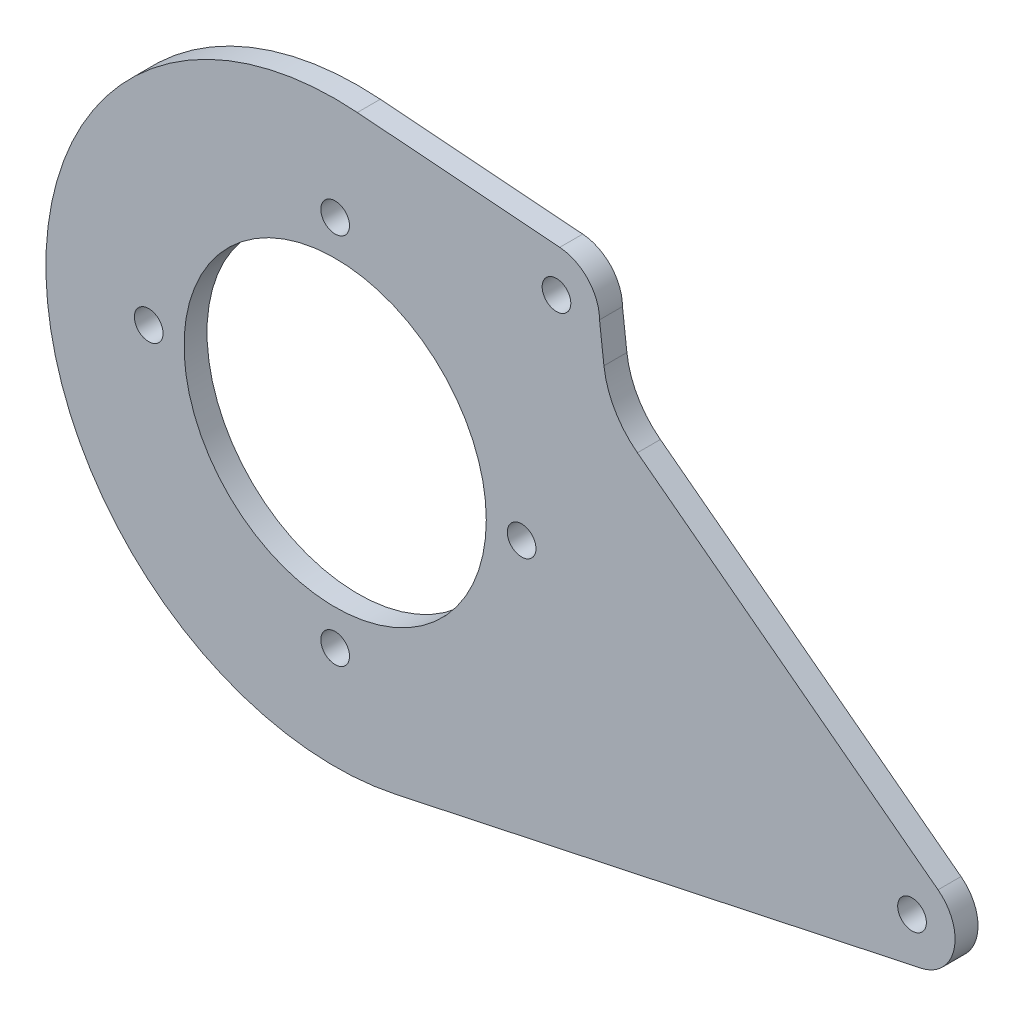
ISO-10303-21;
HEADER;
FILE_DESCRIPTION(('STEP AP214'),'2;1');
FILE_NAME('part.step','',(''),(''),'','','');
FILE_SCHEMA(('AUTOMOTIVE_DESIGN { 1 0 10303 214 1 1 1 1 }'));
ENDSEC;
DATA;
#1=APPLICATION_CONTEXT('core data for automotive mechanical design processes');
#2=APPLICATION_PROTOCOL_DEFINITION('international standard','automotive_design',2000,#1);
#3=PRODUCT_CONTEXT('',#1,'mechanical');
#4=PRODUCT('Part','Part','',(#3));
#5=PRODUCT_RELATED_PRODUCT_CATEGORY('part','',(#4));
#6=PRODUCT_DEFINITION_FORMATION('','',#4);
#7=PRODUCT_DEFINITION_CONTEXT('part definition',#1,'design');
#8=PRODUCT_DEFINITION('design','',#6,#7);
#9=PRODUCT_DEFINITION_SHAPE('','',#8);
#10=(LENGTH_UNIT() NAMED_UNIT(*) SI_UNIT(.MILLI.,.METRE.));
#11=(NAMED_UNIT(*) PLANE_ANGLE_UNIT() SI_UNIT($,.RADIAN.));
#12=(NAMED_UNIT(*) SI_UNIT($,.STERADIAN.) SOLID_ANGLE_UNIT());
#13=UNCERTAINTY_MEASURE_WITH_UNIT(LENGTH_MEASURE(1.E-05),#10,'distance_accuracy_value','');
#14=(GEOMETRIC_REPRESENTATION_CONTEXT(3) GLOBAL_UNCERTAINTY_ASSIGNED_CONTEXT((#13)) GLOBAL_UNIT_ASSIGNED_CONTEXT((#10,
#11,#12)) REPRESENTATION_CONTEXT('',''));
#15=CARTESIAN_POINT('',(0.,0.,0.));
#16=DIRECTION('',(0.,0.,1.));
#17=DIRECTION('',(1.,0.,0.));
#18=AXIS2_PLACEMENT_3D('',#15,#16,#17);
#19=CARTESIAN_POINT('',(0.,0.,10.16));
#20=DIRECTION('',(0.,0.,1.));
#21=DIRECTION('',(1.,0.,0.));
#22=AXIS2_PLACEMENT_3D('',#19,#20,#21);
#23=PLANE('',#22);
#24=CARTESIAN_POINT('',(82.5,0.,10.16));
#25=DIRECTION('',(0.,0.,1.));
#26=DIRECTION('',(1.,0.,0.));
#27=AXIS2_PLACEMENT_3D('',#24,#25,#26);
#28=CIRCLE('',#27,6.35);
#29=CARTESIAN_POINT('',(88.85,0.,10.16));
#30=VERTEX_POINT('',#29);
#31=EDGE_CURVE('E212',#30,#30,#28,.T.);
#32=ORIENTED_EDGE('',*,*,#31,.F.);
#33=EDGE_LOOP('',(#32));
#34=FACE_BOUND('',#33,.T.);
#35=CARTESIAN_POINT('',(-82.5,0.,10.16));
#36=DIRECTION('',(0.,0.,1.));
#37=DIRECTION('',(1.,0.,0.));
#38=AXIS2_PLACEMENT_3D('',#35,#36,#37);
#39=CIRCLE('',#38,6.35);
#40=CARTESIAN_POINT('',(-76.15,0.,10.16));
#41=VERTEX_POINT('',#40);
#42=EDGE_CURVE('E200',#41,#41,#39,.T.);
#43=ORIENTED_EDGE('',*,*,#42,.F.);
#44=EDGE_LOOP('',(#43));
#45=FACE_BOUND('',#44,.T.);
#46=CARTESIAN_POINT('',(0.,0.,10.16));
#47=DIRECTION('',(0.,0.,1.));
#48=DIRECTION('',(1.,0.,0.));
#49=AXIS2_PLACEMENT_3D('',#46,#47,#48);
#50=CIRCLE('',#49,66.87);
#51=CARTESIAN_POINT('',(66.87,0.,10.16));
#52=VERTEX_POINT('',#51);
#53=EDGE_CURVE('E188',#52,#52,#50,.T.);
#54=ORIENTED_EDGE('',*,*,#53,.F.);
#55=EDGE_LOOP('',(#54));
#56=FACE_BOUND('',#55,.T.);
#57=CARTESIAN_POINT('',(0.,0.,10.16));
#58=DIRECTION('',(0.,0.,1.));
#59=DIRECTION('',(1.,0.,0.));
#60=AXIS2_PLACEMENT_3D('',#57,#58,#59);
#61=CIRCLE('',#60,128.);
#62=CARTESIAN_POINT('',(9.80508100267259,127.62390209726,10.16));
#63=VERTEX_POINT('',#62);
#64=CARTESIAN_POINT('',(26.7127683770055,-125.181580137161,10.16));
#65=VERTEX_POINT('',#64);
#66=EDGE_CURVE('E151',#63,#65,#61,.T.);
#67=ORIENTED_EDGE('',*,*,#66,.T.);
#68=DIRECTION('',(0.977981094821572,0.208693502945346,0.));
#69=VECTOR('',#68,1.);
#70=CARTESIAN_POINT('',(26.7127683770055,-125.181580137161,10.16));
#71=LINE('',#70,#69);
#72=CARTESIAN_POINT('',(259.206689864171,-75.5691989310529,10.16));
#73=VERTEX_POINT('',#72);
#74=EDGE_CURVE('E99',#65,#73,#71,.T.);
#75=ORIENTED_EDGE('',*,*,#74,.T.);
#76=CARTESIAN_POINT('',(255.236487197195,-56.9375057502599,10.16));
#77=DIRECTION('',(0.,0.,1.));
#78=DIRECTION('',(1.,0.,0.));
#79=AXIS2_PLACEMENT_3D('',#76,#77,#78);
#80=CIRCLE('',#79,19.0500000000018);
#81=CARTESIAN_POINT('',(266.753249652273,-41.7629651458977,10.16));
#82=VERTEX_POINT('',#81);
#83=EDGE_CURVE('E166',#73,#82,#80,.T.);
#84=ORIENTED_EDGE('',*,*,#83,.T.);
#85=DIRECTION('',(-0.796563811252454,0.604554459584051,0.));
#86=VECTOR('',#85,1.);
#87=CARTESIAN_POINT('',(133.724592453404,59.1995275332562,10.16));
#88=LINE('',#87,#86);
#89=CARTESIAN_POINT('',(133.724592453404,59.1995275332562,10.16));
#90=VERTEX_POINT('',#89);
#91=EDGE_CURVE('E179',#82,#90,#88,.T.);
#92=ORIENTED_EDGE('',*,*,#91,.T.);
#93=CARTESIAN_POINT('',(156.758117363557,89.5486087419742,10.16));
#94=DIRECTION('',(0.,0.,-1.));
#95=DIRECTION('',(-1.,0.,0.));
#96=AXIS2_PLACEMENT_3D('',#93,#94,#95);
#97=CIRCLE('',#96,38.1);
#98=CARTESIAN_POINT('',(118.916102857405,85.1223306083476,10.16));
#99=VERTEX_POINT('',#98);
#100=EDGE_CURVE('E118',#90,#99,#97,.T.);
#101=ORIENTED_EDGE('',*,*,#100,.T.);
#102=DIRECTION('',(-0.116175279097817,0.993228727195576,0.));
#103=VECTOR('',#102,1.);
#104=CARTESIAN_POINT('',(118.916102857405,85.1223306083476,10.16));
#105=LINE('',#104,#103);
#106=CARTESIAN_POINT('',(116.9714473922,101.747964629106,10.16));
#107=VERTEX_POINT('',#106);
#108=EDGE_CURVE('E112',#99,#107,#105,.T.);
#109=ORIENTED_EDGE('',*,*,#108,.T.);
#110=CARTESIAN_POINT('',(97.9214473921997,101.747964629106,10.16));
#111=DIRECTION('',(0.,0.,1.));
#112=DIRECTION('',(1.,0.,0.));
#113=AXIS2_PLACEMENT_3D('',#110,#111,#112);
#114=CIRCLE('',#113,19.05);
#115=CARTESIAN_POINT('',(99.3807192133006,120.741990683425,10.16));
#116=VERTEX_POINT('',#115);
#117=EDGE_CURVE('E116',#107,#116,#114,.T.);
#118=ORIENTED_EDGE('',*,*,#117,.T.);
#119=DIRECTION('',(-0.997061735134844,0.0766021953333798,0.));
#120=VECTOR('',#119,1.);
#121=CARTESIAN_POINT('',(9.80508100267259,127.62390209726,10.16));
#122=LINE('',#121,#120);
#123=EDGE_CURVE('E56',#116,#63,#122,.T.);
#124=ORIENTED_EDGE('',*,*,#123,.T.);
#125=EDGE_LOOP('',(#67,#75,#84,#92,#101,#109,#118,#124));
#126=FACE_BOUND('',#125,.T.);
#127=CARTESIAN_POINT('',(255.236487197195,-56.9375057502599,10.16));
#128=DIRECTION('',(0.,0.,1.));
#129=DIRECTION('',(1.,0.,0.));
#130=AXIS2_PLACEMENT_3D('',#127,#128,#129);
#131=CIRCLE('',#130,6.34999999999994);
#132=CARTESIAN_POINT('',(261.586487197195,-56.9375057502599,10.16));
#133=VERTEX_POINT('',#132);
#134=EDGE_CURVE('E140',#133,#133,#131,.T.);
#135=ORIENTED_EDGE('',*,*,#134,.F.);
#136=EDGE_LOOP('',(#135));
#137=FACE_BOUND('',#136,.T.);
#138=CARTESIAN_POINT('',(0.,82.5,10.16));
#139=DIRECTION('',(0.,0.,1.));
#140=DIRECTION('',(1.,0.,0.));
#141=AXIS2_PLACEMENT_3D('',#138,#139,#140);
#142=CIRCLE('',#141,6.35);
#143=CARTESIAN_POINT('',(6.35,82.5,10.16));
#144=VERTEX_POINT('',#143);
#145=EDGE_CURVE('E194',#144,#144,#142,.T.);
#146=ORIENTED_EDGE('',*,*,#145,.F.);
#147=EDGE_LOOP('',(#146));
#148=FACE_BOUND('',#147,.T.);
#149=CARTESIAN_POINT('',(1.00110585106407E-12,-82.5,10.16));
#150=DIRECTION('',(0.,0.,1.));
#151=DIRECTION('',(1.,0.,0.));
#152=AXIS2_PLACEMENT_3D('',#149,#150,#151);
#153=CIRCLE('',#152,6.35);
#154=CARTESIAN_POINT('',(6.350000000001,-82.5,10.16));
#155=VERTEX_POINT('',#154);
#156=EDGE_CURVE('E206',#155,#155,#153,.T.);
#157=ORIENTED_EDGE('',*,*,#156,.F.);
#158=EDGE_LOOP('',(#157));
#159=FACE_BOUND('',#158,.T.);
#160=CARTESIAN_POINT('',(97.9214473921997,101.747964629106,10.16));
#161=DIRECTION('',(0.,0.,1.));
#162=DIRECTION('',(1.,0.,0.));
#163=AXIS2_PLACEMENT_3D('',#160,#161,#162);
#164=CIRCLE('',#163,6.34999999999999);
#165=CARTESIAN_POINT('',(104.2714473922,101.747964629106,10.16));
#166=VERTEX_POINT('',#165);
#167=EDGE_CURVE('E218',#166,#166,#164,.T.);
#168=ORIENTED_EDGE('',*,*,#167,.F.);
#169=EDGE_LOOP('',(#168));
#170=FACE_BOUND('',#169,.T.);
#171=ADVANCED_FACE('F39',(#34,#45,#56,#126,#137,#148,#159,#170),#23,.T.);
#172=CARTESIAN_POINT('',(0.,0.,0.));
#173=DIRECTION('',(0.,0.,1.));
#174=DIRECTION('',(1.,0.,0.));
#175=AXIS2_PLACEMENT_3D('',#172,#173,#174);
#176=PLANE('',#175);
#177=CARTESIAN_POINT('',(0.,0.,0.));
#178=DIRECTION('',(0.,0.,1.));
#179=DIRECTION('',(1.,0.,0.));
#180=AXIS2_PLACEMENT_3D('',#177,#178,#179);
#181=CIRCLE('',#180,128.);
#182=CARTESIAN_POINT('',(9.80508100267259,127.62390209726,0.));
#183=VERTEX_POINT('',#182);
#184=CARTESIAN_POINT('',(26.7127683770055,-125.181580137161,0.));
#185=VERTEX_POINT('',#184);
#186=EDGE_CURVE('E136',#183,#185,#181,.T.);
#187=ORIENTED_EDGE('',*,*,#186,.F.);
#188=DIRECTION('',(-0.997061735134844,0.0766021953333798,0.));
#189=VECTOR('',#188,1.);
#190=CARTESIAN_POINT('',(9.80508100267259,127.62390209726,0.));
#191=LINE('',#190,#189);
#192=CARTESIAN_POINT('',(99.3807192133006,120.741990683425,0.));
#193=VERTEX_POINT('',#192);
#194=EDGE_CURVE('E91',#193,#183,#191,.T.);
#195=ORIENTED_EDGE('',*,*,#194,.F.);
#196=CARTESIAN_POINT('',(97.9214473921997,101.747964629106,0.));
#197=DIRECTION('',(0.,0.,1.));
#198=DIRECTION('',(1.,0.,0.));
#199=AXIS2_PLACEMENT_3D('',#196,#197,#198);
#200=CIRCLE('',#199,19.05);
#201=CARTESIAN_POINT('',(116.9714473922,101.747964629106,0.));
#202=VERTEX_POINT('',#201);
#203=EDGE_CURVE('E85',#202,#193,#200,.T.);
#204=ORIENTED_EDGE('',*,*,#203,.F.);
#205=DIRECTION('',(-0.116175279097817,0.993228727195576,0.));
#206=VECTOR('',#205,1.);
#207=CARTESIAN_POINT('',(118.916102857405,85.1223306083476,0.));
#208=LINE('',#207,#206);
#209=CARTESIAN_POINT('',(118.916102857405,85.1223306083476,0.));
#210=VERTEX_POINT('',#209);
#211=EDGE_CURVE('E126',#210,#202,#208,.T.);
#212=ORIENTED_EDGE('',*,*,#211,.F.);
#213=CARTESIAN_POINT('',(156.758117363557,89.5486087419742,0.));
#214=DIRECTION('',(0.,0.,-1.));
#215=DIRECTION('',(-1.,0.,0.));
#216=AXIS2_PLACEMENT_3D('',#213,#214,#215);
#217=CIRCLE('',#216,38.1);
#218=CARTESIAN_POINT('',(133.724592453404,59.1995275332562,0.));
#219=VERTEX_POINT('',#218);
#220=EDGE_CURVE('E146',#219,#210,#217,.T.);
#221=ORIENTED_EDGE('',*,*,#220,.F.);
#222=DIRECTION('',(-0.796563811252454,0.604554459584051,0.));
#223=VECTOR('',#222,1.);
#224=CARTESIAN_POINT('',(133.724592453404,59.1995275332562,0.));
#225=LINE('',#224,#223);
#226=CARTESIAN_POINT('',(266.753249652273,-41.7629651458977,0.));
#227=VERTEX_POINT('',#226);
#228=EDGE_CURVE('E144',#227,#219,#225,.T.);
#229=ORIENTED_EDGE('',*,*,#228,.F.);
#230=CARTESIAN_POINT('',(255.236487197195,-56.9375057502599,0.));
#231=DIRECTION('',(0.,0.,1.));
#232=DIRECTION('',(1.,0.,0.));
#233=AXIS2_PLACEMENT_3D('',#230,#231,#232);
#234=CIRCLE('',#233,19.0500000000018);
#235=CARTESIAN_POINT('',(259.206689864171,-75.5691989310529,0.));
#236=VERTEX_POINT('',#235);
#237=EDGE_CURVE('E142',#236,#227,#234,.T.);
#238=ORIENTED_EDGE('',*,*,#237,.F.);
#239=DIRECTION('',(0.977981094821572,0.208693502945346,0.));
#240=VECTOR('',#239,1.);
#241=CARTESIAN_POINT('',(26.7127683770055,-125.181580137161,0.));
#242=LINE('',#241,#240);
#243=EDGE_CURVE('E139',#185,#236,#242,.T.);
#244=ORIENTED_EDGE('',*,*,#243,.F.);
#245=EDGE_LOOP('',(#187,#195,#204,#212,#221,#229,#238,#244));
#246=FACE_BOUND('',#245,.T.);
#247=CARTESIAN_POINT('',(255.236487197195,-56.9375057502599,0.));
#248=DIRECTION('',(0.,0.,1.));
#249=DIRECTION('',(1.,0.,0.));
#250=AXIS2_PLACEMENT_3D('',#247,#248,#249);
#251=CIRCLE('',#250,6.34999999999994);
#252=CARTESIAN_POINT('',(261.586487197195,-56.9375057502599,0.));
#253=VERTEX_POINT('',#252);
#254=EDGE_CURVE('E185',#253,#253,#251,.T.);
#255=ORIENTED_EDGE('',*,*,#254,.T.);
#256=EDGE_LOOP('',(#255));
#257=FACE_BOUND('',#256,.T.);
#258=CARTESIAN_POINT('',(0.,0.,0.));
#259=DIRECTION('',(0.,0.,1.));
#260=DIRECTION('',(1.,0.,0.));
#261=AXIS2_PLACEMENT_3D('',#258,#259,#260);
#262=CIRCLE('',#261,66.87);
#263=CARTESIAN_POINT('',(66.87,0.,0.));
#264=VERTEX_POINT('',#263);
#265=EDGE_CURVE('E191',#264,#264,#262,.T.);
#266=ORIENTED_EDGE('',*,*,#265,.T.);
#267=EDGE_LOOP('',(#266));
#268=FACE_BOUND('',#267,.T.);
#269=CARTESIAN_POINT('',(0.,82.5,0.));
#270=DIRECTION('',(0.,0.,1.));
#271=DIRECTION('',(1.,0.,0.));
#272=AXIS2_PLACEMENT_3D('',#269,#270,#271);
#273=CIRCLE('',#272,6.35);
#274=CARTESIAN_POINT('',(6.35,82.5,0.));
#275=VERTEX_POINT('',#274);
#276=EDGE_CURVE('E197',#275,#275,#273,.T.);
#277=ORIENTED_EDGE('',*,*,#276,.T.);
#278=EDGE_LOOP('',(#277));
#279=FACE_BOUND('',#278,.T.);
#280=CARTESIAN_POINT('',(-82.5,0.,0.));
#281=DIRECTION('',(0.,0.,1.));
#282=DIRECTION('',(1.,0.,0.));
#283=AXIS2_PLACEMENT_3D('',#280,#281,#282);
#284=CIRCLE('',#283,6.35);
#285=CARTESIAN_POINT('',(-76.15,0.,0.));
#286=VERTEX_POINT('',#285);
#287=EDGE_CURVE('E203',#286,#286,#284,.T.);
#288=ORIENTED_EDGE('',*,*,#287,.T.);
#289=EDGE_LOOP('',(#288));
#290=FACE_BOUND('',#289,.T.);
#291=CARTESIAN_POINT('',(1.00110585106407E-12,-82.5,0.));
#292=DIRECTION('',(0.,0.,1.));
#293=DIRECTION('',(1.,0.,0.));
#294=AXIS2_PLACEMENT_3D('',#291,#292,#293);
#295=CIRCLE('',#294,6.35);
#296=CARTESIAN_POINT('',(6.350000000001,-82.5,0.));
#297=VERTEX_POINT('',#296);
#298=EDGE_CURVE('E209',#297,#297,#295,.T.);
#299=ORIENTED_EDGE('',*,*,#298,.T.);
#300=EDGE_LOOP('',(#299));
#301=FACE_BOUND('',#300,.T.);
#302=CARTESIAN_POINT('',(82.5,0.,0.));
#303=DIRECTION('',(0.,0.,1.));
#304=DIRECTION('',(1.,0.,0.));
#305=AXIS2_PLACEMENT_3D('',#302,#303,#304);
#306=CIRCLE('',#305,6.35);
#307=CARTESIAN_POINT('',(88.85,0.,0.));
#308=VERTEX_POINT('',#307);
#309=EDGE_CURVE('E215',#308,#308,#306,.T.);
#310=ORIENTED_EDGE('',*,*,#309,.T.);
#311=EDGE_LOOP('',(#310));
#312=FACE_BOUND('',#311,.T.);
#313=CARTESIAN_POINT('',(97.9214473921997,101.747964629106,0.));
#314=DIRECTION('',(0.,0.,1.));
#315=DIRECTION('',(1.,0.,0.));
#316=AXIS2_PLACEMENT_3D('',#313,#314,#315);
#317=CIRCLE('',#316,6.34999999999999);
#318=CARTESIAN_POINT('',(104.2714473922,101.747964629106,0.));
#319=VERTEX_POINT('',#318);
#320=EDGE_CURVE('E221',#319,#319,#317,.T.);
#321=ORIENTED_EDGE('',*,*,#320,.T.);
#322=EDGE_LOOP('',(#321));
#323=FACE_BOUND('',#322,.T.);
#324=ADVANCED_FACE('F170',(#246,#257,#268,#279,#290,#301,#312,#323),#176,.F.);
#325=CARTESIAN_POINT('',(0.,0.,10.16));
#326=DIRECTION('',(0.,0.,-1.));
#327=DIRECTION('',(-1.,0.,0.));
#328=AXIS2_PLACEMENT_3D('',#325,#326,#327);
#329=CYLINDRICAL_SURFACE('',#328,128.);
#330=ORIENTED_EDGE('',*,*,#186,.T.);
#331=DIRECTION('',(0.,0.,-1.));
#332=VECTOR('',#331,1.);
#333=CARTESIAN_POINT('',(26.7127683770055,-125.181580137161,10.16));
#334=LINE('',#333,#332);
#335=EDGE_CURVE('E11',#65,#185,#334,.T.);
#336=ORIENTED_EDGE('',*,*,#335,.F.);
#337=ORIENTED_EDGE('',*,*,#66,.F.);
#338=DIRECTION('',(0.,0.,-1.));
#339=VECTOR('',#338,1.);
#340=CARTESIAN_POINT('',(9.80508100267259,127.62390209726,10.16));
#341=LINE('',#340,#339);
#342=EDGE_CURVE('E132',#63,#183,#341,.T.);
#343=ORIENTED_EDGE('',*,*,#342,.T.);
#344=EDGE_LOOP('',(#330,#336,#337,#343));
#345=FACE_BOUND('',#344,.T.);
#346=ADVANCED_FACE('F41',(#345),#329,.T.);
#347=CARTESIAN_POINT('',(26.7127683770055,-125.181580137161,10.16));
#348=DIRECTION('',(-0.208693502945346,0.977981094821572,0.));
#349=DIRECTION('',(-0.977981094821572,-0.208693502945346,0.));
#350=AXIS2_PLACEMENT_3D('',#347,#348,#349);
#351=PLANE('',#350);
#352=ORIENTED_EDGE('',*,*,#243,.T.);
#353=DIRECTION('',(0.,0.,-1.));
#354=VECTOR('',#353,1.);
#355=CARTESIAN_POINT('',(259.206689864171,-75.5691989310529,10.16));
#356=LINE('',#355,#354);
#357=EDGE_CURVE('E48',#73,#236,#356,.T.);
#358=ORIENTED_EDGE('',*,*,#357,.F.);
#359=ORIENTED_EDGE('',*,*,#74,.F.);
#360=ORIENTED_EDGE('',*,*,#335,.T.);
#361=EDGE_LOOP('',(#352,#358,#359,#360));
#362=FACE_BOUND('',#361,.T.);
#363=ADVANCED_FACE('F255',(#362),#351,.F.);
#364=CARTESIAN_POINT('',(255.236487197195,-56.9375057502599,10.16));
#365=DIRECTION('',(0.,0.,-1.));
#366=DIRECTION('',(-1.,0.,0.));
#367=AXIS2_PLACEMENT_3D('',#364,#365,#366);
#368=CYLINDRICAL_SURFACE('',#367,19.0500000000018);
#369=ORIENTED_EDGE('',*,*,#237,.T.);
#370=DIRECTION('',(0.,0.,-1.));
#371=VECTOR('',#370,1.);
#372=CARTESIAN_POINT('',(266.753249652273,-41.7629651458977,10.16));
#373=LINE('',#372,#371);
#374=EDGE_CURVE('E158',#82,#227,#373,.T.);
#375=ORIENTED_EDGE('',*,*,#374,.F.);
#376=ORIENTED_EDGE('',*,*,#83,.F.);
#377=ORIENTED_EDGE('',*,*,#357,.T.);
#378=EDGE_LOOP('',(#369,#375,#376,#377));
#379=FACE_BOUND('',#378,.T.);
#380=ADVANCED_FACE('F164',(#379),#368,.T.);
#381=CARTESIAN_POINT('',(133.724592453404,59.1995275332562,10.16));
#382=DIRECTION('',(-0.604554459584051,-0.796563811252454,0.));
#383=DIRECTION('',(0.796563811252454,-0.604554459584051,0.));
#384=AXIS2_PLACEMENT_3D('',#381,#382,#383);
#385=PLANE('',#384);
#386=ORIENTED_EDGE('',*,*,#228,.T.);
#387=DIRECTION('',(0.,0.,-1.));
#388=VECTOR('',#387,1.);
#389=CARTESIAN_POINT('',(133.724592453404,59.1995275332562,10.16));
#390=LINE('',#389,#388);
#391=EDGE_CURVE('E155',#90,#219,#390,.T.);
#392=ORIENTED_EDGE('',*,*,#391,.F.);
#393=ORIENTED_EDGE('',*,*,#91,.F.);
#394=ORIENTED_EDGE('',*,*,#374,.T.);
#395=EDGE_LOOP('',(#386,#392,#393,#394));
#396=FACE_BOUND('',#395,.T.);
#397=ADVANCED_FACE('F175',(#396),#385,.F.);
#398=CARTESIAN_POINT('',(156.758117363557,89.5486087419742,10.16));
#399=DIRECTION('',(0.,0.,-1.));
#400=DIRECTION('',(-1.,0.,0.));
#401=AXIS2_PLACEMENT_3D('',#398,#399,#400);
#402=CYLINDRICAL_SURFACE('',#401,38.1);
#403=ORIENTED_EDGE('',*,*,#220,.T.);
#404=DIRECTION('',(0.,0.,-1.));
#405=VECTOR('',#404,1.);
#406=CARTESIAN_POINT('',(118.916102857405,85.1223306083476,10.16));
#407=LINE('',#406,#405);
#408=EDGE_CURVE('E127',#99,#210,#407,.T.);
#409=ORIENTED_EDGE('',*,*,#408,.F.);
#410=ORIENTED_EDGE('',*,*,#100,.F.);
#411=ORIENTED_EDGE('',*,*,#391,.T.);
#412=EDGE_LOOP('',(#403,#409,#410,#411));
#413=FACE_BOUND('',#412,.T.);
#414=ADVANCED_FACE('F178',(#413),#402,.F.);
#415=CARTESIAN_POINT('',(118.916102857405,85.1223306083476,10.16));
#416=DIRECTION('',(-0.993228727195576,-0.116175279097817,0.));
#417=DIRECTION('',(0.116175279097817,-0.993228727195576,0.));
#418=AXIS2_PLACEMENT_3D('',#415,#416,#417);
#419=PLANE('',#418);
#420=ORIENTED_EDGE('',*,*,#211,.T.);
#421=DIRECTION('',(0.,0.,-1.));
#422=VECTOR('',#421,1.);
#423=CARTESIAN_POINT('',(116.9714473922,101.747964629106,10.16));
#424=LINE('',#423,#422);
#425=EDGE_CURVE('E123',#107,#202,#424,.T.);
#426=ORIENTED_EDGE('',*,*,#425,.F.);
#427=ORIENTED_EDGE('',*,*,#108,.F.);
#428=ORIENTED_EDGE('',*,*,#408,.T.);
#429=EDGE_LOOP('',(#420,#426,#427,#428));
#430=FACE_BOUND('',#429,.T.);
#431=ADVANCED_FACE('F124',(#430),#419,.F.);
#432=CARTESIAN_POINT('',(97.9214473921997,101.747964629106,10.16));
#433=DIRECTION('',(0.,0.,-1.));
#434=DIRECTION('',(-1.,0.,0.));
#435=AXIS2_PLACEMENT_3D('',#432,#433,#434);
#436=CYLINDRICAL_SURFACE('',#435,19.05);
#437=ORIENTED_EDGE('',*,*,#203,.T.);
#438=DIRECTION('',(0.,0.,-1.));
#439=VECTOR('',#438,1.);
#440=CARTESIAN_POINT('',(99.3807192133006,120.741990683425,10.16));
#441=LINE('',#440,#439);
#442=EDGE_CURVE('E128',#116,#193,#441,.T.);
#443=ORIENTED_EDGE('',*,*,#442,.F.);
#444=ORIENTED_EDGE('',*,*,#117,.F.);
#445=ORIENTED_EDGE('',*,*,#425,.T.);
#446=EDGE_LOOP('',(#437,#443,#444,#445));
#447=FACE_BOUND('',#446,.T.);
#448=ADVANCED_FACE('F130',(#447),#436,.T.);
#449=CARTESIAN_POINT('',(9.80508100267259,127.62390209726,10.16));
#450=DIRECTION('',(-0.0766021953333798,-0.997061735134845,0.));
#451=DIRECTION('',(0.997061735134845,-0.0766021953333798,0.));
#452=AXIS2_PLACEMENT_3D('',#449,#450,#451);
#453=PLANE('',#452);
#454=ORIENTED_EDGE('',*,*,#194,.T.);
#455=ORIENTED_EDGE('',*,*,#342,.F.);
#456=ORIENTED_EDGE('',*,*,#123,.F.);
#457=ORIENTED_EDGE('',*,*,#442,.T.);
#458=EDGE_LOOP('',(#454,#455,#456,#457));
#459=FACE_BOUND('',#458,.T.);
#460=ADVANCED_FACE('F243',(#459),#453,.F.);
#461=CARTESIAN_POINT('',(255.236487197195,-56.9375057502599,10.16));
#462=DIRECTION('',(0.,0.,-1.));
#463=DIRECTION('',(-1.,0.,0.));
#464=AXIS2_PLACEMENT_3D('',#461,#462,#463);
#465=CYLINDRICAL_SURFACE('',#464,6.34999999999994);
#466=ORIENTED_EDGE('',*,*,#134,.T.);
#467=EDGE_LOOP('',(#466));
#468=FACE_BOUND('',#467,.T.);
#469=ORIENTED_EDGE('',*,*,#254,.F.);
#470=EDGE_LOOP('',(#469));
#471=FACE_BOUND('',#470,.T.);
#472=ADVANCED_FACE('F240',(#468,#471),#465,.F.);
#473=CARTESIAN_POINT('',(0.,0.,10.16));
#474=DIRECTION('',(0.,0.,-1.));
#475=DIRECTION('',(-1.,0.,0.));
#476=AXIS2_PLACEMENT_3D('',#473,#474,#475);
#477=CYLINDRICAL_SURFACE('',#476,66.87);
#478=ORIENTED_EDGE('',*,*,#53,.T.);
#479=EDGE_LOOP('',(#478));
#480=FACE_BOUND('',#479,.T.);
#481=ORIENTED_EDGE('',*,*,#265,.F.);
#482=EDGE_LOOP('',(#481));
#483=FACE_BOUND('',#482,.T.);
#484=ADVANCED_FACE('F331',(#480,#483),#477,.F.);
#485=CARTESIAN_POINT('',(0.,82.5,10.16));
#486=DIRECTION('',(0.,0.,-1.));
#487=DIRECTION('',(-1.,0.,0.));
#488=AXIS2_PLACEMENT_3D('',#485,#486,#487);
#489=CYLINDRICAL_SURFACE('',#488,6.35);
#490=ORIENTED_EDGE('',*,*,#145,.T.);
#491=EDGE_LOOP('',(#490));
#492=FACE_BOUND('',#491,.T.);
#493=ORIENTED_EDGE('',*,*,#276,.F.);
#494=EDGE_LOOP('',(#493));
#495=FACE_BOUND('',#494,.T.);
#496=ADVANCED_FACE('F340',(#492,#495),#489,.F.);
#497=CARTESIAN_POINT('',(-82.5,0.,10.16));
#498=DIRECTION('',(0.,0.,-1.));
#499=DIRECTION('',(-1.,0.,0.));
#500=AXIS2_PLACEMENT_3D('',#497,#498,#499);
#501=CYLINDRICAL_SURFACE('',#500,6.35);
#502=ORIENTED_EDGE('',*,*,#42,.T.);
#503=EDGE_LOOP('',(#502));
#504=FACE_BOUND('',#503,.T.);
#505=ORIENTED_EDGE('',*,*,#287,.F.);
#506=EDGE_LOOP('',(#505));
#507=FACE_BOUND('',#506,.T.);
#508=ADVANCED_FACE('F349',(#504,#507),#501,.F.);
#509=CARTESIAN_POINT('',(1.00110585106407E-12,-82.5,10.16));
#510=DIRECTION('',(0.,0.,-1.));
#511=DIRECTION('',(-1.,0.,0.));
#512=AXIS2_PLACEMENT_3D('',#509,#510,#511);
#513=CYLINDRICAL_SURFACE('',#512,6.35);
#514=ORIENTED_EDGE('',*,*,#156,.T.);
#515=EDGE_LOOP('',(#514));
#516=FACE_BOUND('',#515,.T.);
#517=ORIENTED_EDGE('',*,*,#298,.F.);
#518=EDGE_LOOP('',(#517));
#519=FACE_BOUND('',#518,.T.);
#520=ADVANCED_FACE('F359',(#516,#519),#513,.F.);
#521=CARTESIAN_POINT('',(82.5,0.,10.16));
#522=DIRECTION('',(0.,0.,-1.));
#523=DIRECTION('',(-1.,0.,0.));
#524=AXIS2_PLACEMENT_3D('',#521,#522,#523);
#525=CYLINDRICAL_SURFACE('',#524,6.35);
#526=ORIENTED_EDGE('',*,*,#31,.T.);
#527=EDGE_LOOP('',(#526));
#528=FACE_BOUND('',#527,.T.);
#529=ORIENTED_EDGE('',*,*,#309,.F.);
#530=EDGE_LOOP('',(#529));
#531=FACE_BOUND('',#530,.T.);
#532=ADVANCED_FACE('F369',(#528,#531),#525,.F.);
#533=CARTESIAN_POINT('',(97.9214473921997,101.747964629106,10.16));
#534=DIRECTION('',(0.,0.,-1.));
#535=DIRECTION('',(-1.,0.,0.));
#536=AXIS2_PLACEMENT_3D('',#533,#534,#535);
#537=CYLINDRICAL_SURFACE('',#536,6.34999999999999);
#538=ORIENTED_EDGE('',*,*,#167,.T.);
#539=EDGE_LOOP('',(#538));
#540=FACE_BOUND('',#539,.T.);
#541=ORIENTED_EDGE('',*,*,#320,.F.);
#542=EDGE_LOOP('',(#541));
#543=FACE_BOUND('',#542,.T.);
#544=ADVANCED_FACE('F227',(#540,#543),#537,.F.);
#545=CLOSED_SHELL('',(#171,#324,#346,#363,#380,#397,#414,#431,#448,#460,#472,#484,#496,#508,
#520,#532,#544));
#546=MANIFOLD_SOLID_BREP('B2',#545);
#547=ADVANCED_BREP_SHAPE_REPRESENTATION('',(#18,#546),#14);
#548=SHAPE_DEFINITION_REPRESENTATION(#9,#547);
ENDSEC;
END-ISO-10303-21;
